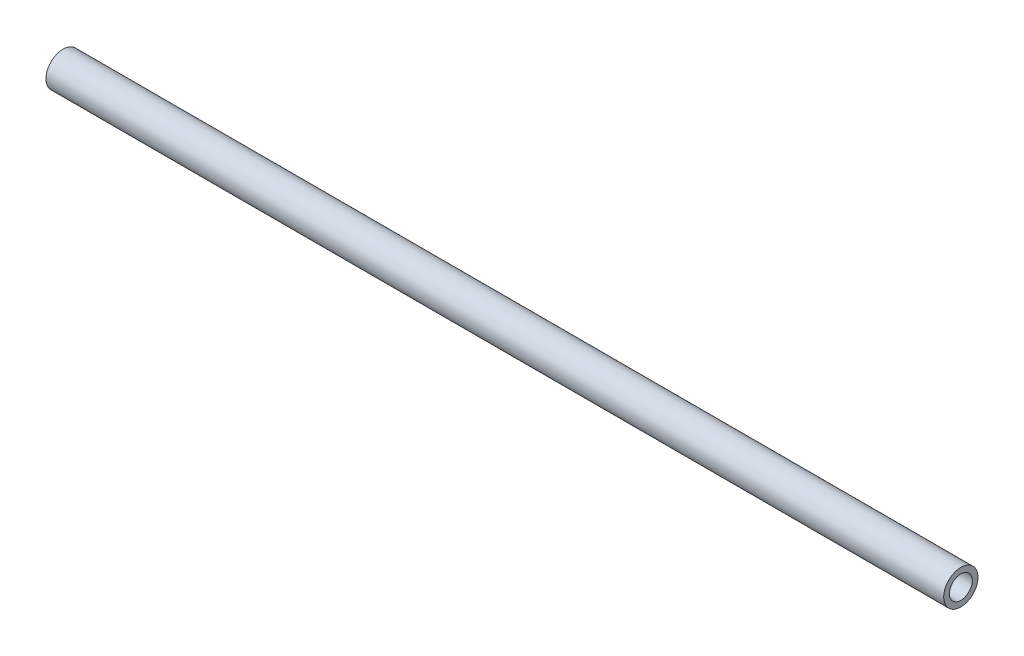
ISO-10303-21;
HEADER;
FILE_DESCRIPTION(('STEP AP214'),'2;1');
FILE_NAME('part.step','',(''),(''),'','','');
FILE_SCHEMA(('AUTOMOTIVE_DESIGN { 1 0 10303 214 1 1 1 1 }'));
ENDSEC;
DATA;
#1=APPLICATION_CONTEXT('core data for automotive mechanical design processes');
#2=APPLICATION_PROTOCOL_DEFINITION('international standard','automotive_design',2000,#1);
#3=PRODUCT_CONTEXT('',#1,'mechanical');
#4=PRODUCT('Part','Part','',(#3));
#5=PRODUCT_RELATED_PRODUCT_CATEGORY('part','',(#4));
#6=PRODUCT_DEFINITION_FORMATION('','',#4);
#7=PRODUCT_DEFINITION_CONTEXT('part definition',#1,'design');
#8=PRODUCT_DEFINITION('design','',#6,#7);
#9=PRODUCT_DEFINITION_SHAPE('','',#8);
#10=(LENGTH_UNIT() NAMED_UNIT(*) SI_UNIT(.MILLI.,.METRE.));
#11=(NAMED_UNIT(*) PLANE_ANGLE_UNIT() SI_UNIT($,.RADIAN.));
#12=(NAMED_UNIT(*) SI_UNIT($,.STERADIAN.) SOLID_ANGLE_UNIT());
#13=UNCERTAINTY_MEASURE_WITH_UNIT(LENGTH_MEASURE(1.E-05),#10,'distance_accuracy_value','');
#14=(GEOMETRIC_REPRESENTATION_CONTEXT(3) GLOBAL_UNCERTAINTY_ASSIGNED_CONTEXT((#13)) GLOBAL_UNIT_ASSIGNED_CONTEXT((#10,
#11,#12)) REPRESENTATION_CONTEXT('',''));
#15=CARTESIAN_POINT('',(0.,0.,0.));
#16=DIRECTION('',(0.,0.,1.));
#17=DIRECTION('',(1.,0.,0.));
#18=AXIS2_PLACEMENT_3D('',#15,#16,#17);
#19=CARTESIAN_POINT('',(0.,0.,0.));
#20=DIRECTION('',(1.,0.,0.));
#21=DIRECTION('',(0.,0.,-1.));
#22=AXIS2_PLACEMENT_3D('',#19,#20,#21);
#23=CYLINDRICAL_SURFACE('',#22,3.00000000000001);
#24=CARTESIAN_POINT('',(0.,0.,0.));
#25=DIRECTION('',(1.,0.,0.));
#26=DIRECTION('',(0.,0.,-1.));
#27=AXIS2_PLACEMENT_3D('',#24,#25,#26);
#28=CIRCLE('',#27,3.);
#29=CARTESIAN_POINT('',(0.,0.,-3.));
#30=VERTEX_POINT('',#29);
#31=EDGE_CURVE('E10',#30,#30,#28,.T.);
#32=ORIENTED_EDGE('',*,*,#31,.T.);
#33=EDGE_LOOP('',(#32));
#34=FACE_BOUND('',#33,.T.);
#35=CARTESIAN_POINT('',(157.,0.,0.));
#36=DIRECTION('',(1.,0.,0.));
#37=DIRECTION('',(0.,0.,-1.));
#38=AXIS2_PLACEMENT_3D('',#35,#36,#37);
#39=CIRCLE('',#38,3.00000000000002);
#40=CARTESIAN_POINT('',(157.,0.,-3.00000000000002));
#41=VERTEX_POINT('',#40);
#42=EDGE_CURVE('E50',#41,#41,#39,.T.);
#43=ORIENTED_EDGE('',*,*,#42,.F.);
#44=EDGE_LOOP('',(#43));
#45=FACE_BOUND('',#44,.T.);
#46=ADVANCED_FACE('F43',(#34,#45),#23,.T.);
#47=CARTESIAN_POINT('',(0.,3.,0.));
#48=DIRECTION('',(-1.,0.,0.));
#49=DIRECTION('',(0.,0.,1.));
#50=AXIS2_PLACEMENT_3D('',#47,#48,#49);
#51=PLANE('',#50);
#52=CARTESIAN_POINT('',(0.,0.,0.));
#53=DIRECTION('',(-1.,0.,0.));
#54=DIRECTION('',(0.,0.,1.));
#55=AXIS2_PLACEMENT_3D('',#52,#53,#54);
#56=CIRCLE('',#55,2.);
#57=CARTESIAN_POINT('',(0.,0.,2.));
#58=VERTEX_POINT('',#57);
#59=EDGE_CURVE('E60',#58,#58,#56,.T.);
#60=ORIENTED_EDGE('',*,*,#59,.F.);
#61=EDGE_LOOP('',(#60));
#62=FACE_BOUND('',#61,.T.);
#63=ORIENTED_EDGE('',*,*,#31,.F.);
#64=EDGE_LOOP('',(#63));
#65=FACE_BOUND('',#64,.T.);
#66=ADVANCED_FACE('F69',(#62,#65),#51,.T.);
#67=CARTESIAN_POINT('',(157.,0.,0.));
#68=DIRECTION('',(1.,0.,0.));
#69=DIRECTION('',(0.,0.,-1.));
#70=AXIS2_PLACEMENT_3D('',#67,#68,#69);
#71=PLANE('',#70);
#72=CARTESIAN_POINT('',(157.,0.,0.));
#73=DIRECTION('',(-1.,0.,0.));
#74=DIRECTION('',(0.,0.,1.));
#75=AXIS2_PLACEMENT_3D('',#72,#73,#74);
#76=CIRCLE('',#75,2.);
#77=CARTESIAN_POINT('',(157.,0.,2.));
#78=VERTEX_POINT('',#77);
#79=EDGE_CURVE('E55',#78,#78,#76,.T.);
#80=ORIENTED_EDGE('',*,*,#79,.T.);
#81=EDGE_LOOP('',(#80));
#82=FACE_BOUND('',#81,.T.);
#83=ORIENTED_EDGE('',*,*,#42,.T.);
#84=EDGE_LOOP('',(#83));
#85=FACE_BOUND('',#84,.T.);
#86=ADVANCED_FACE('F72',(#82,#85),#71,.T.);
#87=CARTESIAN_POINT('',(157.,0.,0.));
#88=DIRECTION('',(-1.,0.,0.));
#89=DIRECTION('',(0.,0.,1.));
#90=AXIS2_PLACEMENT_3D('',#87,#88,#89);
#91=CYLINDRICAL_SURFACE('',#90,2.);
#92=ORIENTED_EDGE('',*,*,#79,.F.);
#93=EDGE_LOOP('',(#92));
#94=FACE_BOUND('',#93,.T.);
#95=ORIENTED_EDGE('',*,*,#59,.T.);
#96=EDGE_LOOP('',(#95));
#97=FACE_BOUND('',#96,.T.);
#98=ADVANCED_FACE('F67',(#94,#97),#91,.F.);
#99=CLOSED_SHELL('',(#46,#66,#86,#98));
#100=MANIFOLD_SOLID_BREP('B2',#99);
#101=ADVANCED_BREP_SHAPE_REPRESENTATION('',(#18,#100),#14);
#102=SHAPE_DEFINITION_REPRESENTATION(#9,#101);
ENDSEC;
END-ISO-10303-21;
